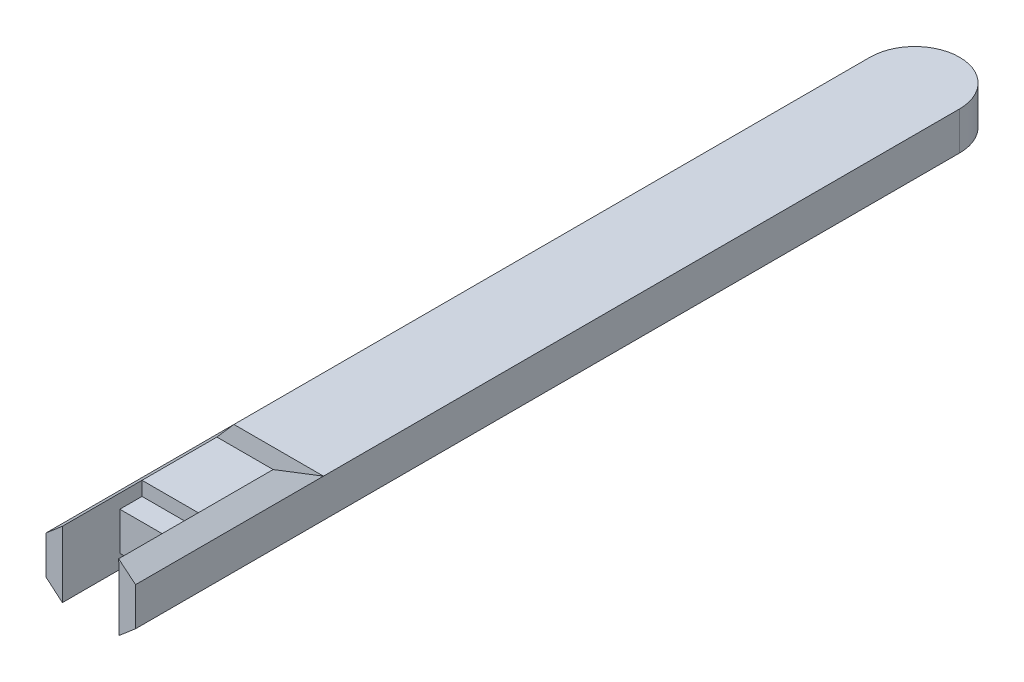
ISO-10303-21;
HEADER;
FILE_DESCRIPTION(('STEP AP214'),'2;1');
FILE_NAME('part.step','',(''),(''),'','','');
FILE_SCHEMA(('AUTOMOTIVE_DESIGN { 1 0 10303 214 1 1 1 1 }'));
ENDSEC;
DATA;
#1=APPLICATION_CONTEXT('core data for automotive mechanical design processes');
#2=APPLICATION_PROTOCOL_DEFINITION('international standard','automotive_design',2000,#1);
#3=PRODUCT_CONTEXT('',#1,'mechanical');
#4=PRODUCT('Part','Part','',(#3));
#5=PRODUCT_RELATED_PRODUCT_CATEGORY('part','',(#4));
#6=PRODUCT_DEFINITION_FORMATION('','',#4);
#7=PRODUCT_DEFINITION_CONTEXT('part definition',#1,'design');
#8=PRODUCT_DEFINITION('design','',#6,#7);
#9=PRODUCT_DEFINITION_SHAPE('','',#8);
#10=(LENGTH_UNIT() NAMED_UNIT(*) SI_UNIT(.MILLI.,.METRE.));
#11=(NAMED_UNIT(*) PLANE_ANGLE_UNIT() SI_UNIT($,.RADIAN.));
#12=(NAMED_UNIT(*) SI_UNIT($,.STERADIAN.) SOLID_ANGLE_UNIT());
#13=UNCERTAINTY_MEASURE_WITH_UNIT(LENGTH_MEASURE(1.E-05),#10,'distance_accuracy_value','');
#14=(GEOMETRIC_REPRESENTATION_CONTEXT(3) GLOBAL_UNCERTAINTY_ASSIGNED_CONTEXT((#13)) GLOBAL_UNIT_ASSIGNED_CONTEXT((#10,
#11,#12)) REPRESENTATION_CONTEXT('',''));
#15=CARTESIAN_POINT('',(0.,0.,0.));
#16=DIRECTION('',(0.,0.,1.));
#17=DIRECTION('',(1.,0.,0.));
#18=AXIS2_PLACEMENT_3D('',#15,#16,#17);
#19=CARTESIAN_POINT('',(0.,0.,0.));
#20=DIRECTION('',(0.,1.,0.));
#21=DIRECTION('',(0.,0.,1.));
#22=AXIS2_PLACEMENT_3D('',#19,#20,#21);
#23=PLANE('',#22);
#24=DIRECTION('',(0.,0.,1.));
#25=VECTOR('',#24,1.);
#26=CARTESIAN_POINT('',(-4.24999999999999,0.,49.7));
#27=LINE('',#26,#25);
#28=CARTESIAN_POINT('',(-4.24999999999999,0.,49.73));
#29=VERTEX_POINT('',#28);
#30=CARTESIAN_POINT('',(-4.24999999999999,0.,53.05));
#31=VERTEX_POINT('',#30);
#32=EDGE_CURVE('E403',#29,#31,#27,.T.);
#33=ORIENTED_EDGE('',*,*,#32,.F.);
#34=DIRECTION('',(1.,0.,0.));
#35=VECTOR('',#34,1.);
#36=CARTESIAN_POINT('',(-6.69999999999999,0.,49.73));
#37=LINE('',#36,#35);
#38=CARTESIAN_POINT('',(4.24550605108262,0.,49.73));
#39=VERTEX_POINT('',#38);
#40=EDGE_CURVE('E209',#29,#39,#37,.T.);
#41=ORIENTED_EDGE('',*,*,#40,.T.);
#42=DIRECTION('',(0.,0.,1.));
#43=VECTOR('',#42,1.);
#44=CARTESIAN_POINT('',(4.24550605108262,0.,49.7));
#45=LINE('',#44,#43);
#46=CARTESIAN_POINT('',(4.24550605108262,0.,53.05));
#47=VERTEX_POINT('',#46);
#48=EDGE_CURVE('E378',#39,#47,#45,.T.);
#49=ORIENTED_EDGE('',*,*,#48,.T.);
#50=DIRECTION('',(1.,0.,0.));
#51=VECTOR('',#50,1.);
#52=CARTESIAN_POINT('',(-4.24999999999999,0.,53.05));
#53=LINE('',#52,#51);
#54=EDGE_CURVE('E322',#31,#47,#53,.T.);
#55=ORIENTED_EDGE('',*,*,#54,.F.);
#56=EDGE_LOOP('',(#33,#41,#49,#55));
#57=FACE_BOUND('',#56,.T.);
#58=ADVANCED_FACE('F46',(#57),#23,.F.);
#59=CARTESIAN_POINT('',(-6.69999999999999,-2.09,49.73));
#60=DIRECTION('',(0.,0.,1.));
#61=DIRECTION('',(1.,0.,0.));
#62=AXIS2_PLACEMENT_3D('',#59,#60,#61);
#63=PLANE('',#62);
#64=ORIENTED_EDGE('',*,*,#40,.F.);
#65=DIRECTION('',(0.,-1.,0.));
#66=VECTOR('',#65,1.);
#67=CARTESIAN_POINT('',(-4.24999999999999,-2.09,49.73));
#68=LINE('',#67,#66);
#69=CARTESIAN_POINT('',(-4.24999999999999,-2.09,49.73));
#70=VERTEX_POINT('',#69);
#71=EDGE_CURVE('E399',#29,#70,#68,.T.);
#72=ORIENTED_EDGE('',*,*,#71,.T.);
#73=DIRECTION('',(1.,0.,0.));
#74=VECTOR('',#73,1.);
#75=CARTESIAN_POINT('',(-6.69999999999999,-2.09,49.73));
#76=LINE('',#75,#74);
#77=CARTESIAN_POINT('',(4.24550605108262,-2.09,49.73));
#78=VERTEX_POINT('',#77);
#79=EDGE_CURVE('E215',#70,#78,#76,.T.);
#80=ORIENTED_EDGE('',*,*,#79,.T.);
#81=DIRECTION('',(0.,-1.,0.));
#82=VECTOR('',#81,1.);
#83=CARTESIAN_POINT('',(4.24550605108261,-2.09,49.73));
#84=LINE('',#83,#82);
#85=EDGE_CURVE('E370',#39,#78,#84,.T.);
#86=ORIENTED_EDGE('',*,*,#85,.F.);
#87=EDGE_LOOP('',(#64,#72,#80,#86));
#88=FACE_BOUND('',#87,.T.);
#89=ADVANCED_FACE('F422',(#88),#63,.T.);
#90=CARTESIAN_POINT('',(-6.69999999999999,0.,49.73));
#91=DIRECTION('',(0.,0.,1.));
#92=DIRECTION('',(1.,0.,0.));
#93=AXIS2_PLACEMENT_3D('',#90,#91,#92);
#94=PLANE('',#93);
#95=DIRECTION('',(0.0384362054872678,-0.999261056034778,0.));
#96=VECTOR('',#95,1.);
#97=CARTESIAN_POINT('',(4.45351574107098,0.429015841596412,49.73));
#98=LINE('',#97,#96);
#99=CARTESIAN_POINT('',(4.16960892603265,7.81,49.73));
#100=VERTEX_POINT('',#99);
#101=CARTESIAN_POINT('',(4.25000000000001,5.72,49.73));
#102=VERTEX_POINT('',#101);
#103=EDGE_CURVE('E284',#100,#102,#98,.T.);
#104=ORIENTED_EDGE('',*,*,#103,.F.);
#105=DIRECTION('',(1.,0.,0.));
#106=VECTOR('',#105,1.);
#107=CARTESIAN_POINT('',(-6.69999999999999,7.81,49.73));
#108=LINE('',#107,#106);
#109=CARTESIAN_POINT('',(-4.24999999999999,7.81,49.73));
#110=VERTEX_POINT('',#109);
#111=EDGE_CURVE('E231',#110,#100,#108,.T.);
#112=ORIENTED_EDGE('',*,*,#111,.F.);
#113=DIRECTION('',(0.,1.,0.));
#114=VECTOR('',#113,1.);
#115=CARTESIAN_POINT('',(-4.24999999999999,0.,49.73));
#116=LINE('',#115,#114);
#117=CARTESIAN_POINT('',(-4.24999999999999,5.72,49.73));
#118=VERTEX_POINT('',#117);
#119=EDGE_CURVE('E305',#118,#110,#116,.T.);
#120=ORIENTED_EDGE('',*,*,#119,.F.);
#121=DIRECTION('',(1.,0.,0.));
#122=VECTOR('',#121,1.);
#123=CARTESIAN_POINT('',(-6.69999999999999,5.72,49.73));
#124=LINE('',#123,#122);
#125=EDGE_CURVE('E227',#118,#102,#124,.T.);
#126=ORIENTED_EDGE('',*,*,#125,.T.);
#127=EDGE_LOOP('',(#104,#112,#120,#126));
#128=FACE_BOUND('',#127,.T.);
#129=ADVANCED_FACE('F291',(#128),#94,.T.);
#130=CARTESIAN_POINT('',(0.,5.72,61.65));
#131=DIRECTION('',(0.,0.,1.));
#132=DIRECTION('',(1.,0.,0.));
#133=AXIS2_PLACEMENT_3D('',#130,#131,#132);
#134=PLANE('',#133);
#135=DIRECTION('',(0.,-1.,0.));
#136=VECTOR('',#135,1.);
#137=CARTESIAN_POINT('',(4.25000000000001,13.4,61.65));
#138=LINE('',#137,#136);
#139=CARTESIAN_POINT('',(4.25000000000001,5.72,61.65));
#140=VERTEX_POINT('',#139);
#141=CARTESIAN_POINT('',(4.25000000000001,0.,61.65));
#142=VERTEX_POINT('',#141);
#143=EDGE_CURVE('E331',#140,#142,#138,.T.);
#144=ORIENTED_EDGE('',*,*,#143,.T.);
#145=DIRECTION('',(-1.,0.,0.));
#146=VECTOR('',#145,1.);
#147=CARTESIAN_POINT('',(6.70000000000001,0.,61.65));
#148=LINE('',#147,#146);
#149=CARTESIAN_POINT('',(4.24550605108262,0.,61.65));
#150=VERTEX_POINT('',#149);
#151=EDGE_CURVE('E389',#142,#150,#148,.T.);
#152=ORIENTED_EDGE('',*,*,#151,.T.);
#153=DIRECTION('',(0.,-1.,0.));
#154=VECTOR('',#153,1.);
#155=CARTESIAN_POINT('',(4.24550605108262,0.,61.65));
#156=LINE('',#155,#154);
#157=CARTESIAN_POINT('',(4.24550605108262,-2.09,61.65));
#158=VERTEX_POINT('',#157);
#159=EDGE_CURVE('E385',#150,#158,#156,.T.);
#160=ORIENTED_EDGE('',*,*,#159,.T.);
#161=DIRECTION('',(0.761375701340681,0.648310914151525,0.));
#162=VECTOR('',#161,1.);
#163=CARTESIAN_POINT('',(4.24550605108262,-2.09,61.65));
#164=LINE('',#163,#162);
#165=CARTESIAN_POINT('',(6.70000000000001,0.,61.65));
#166=VERTEX_POINT('',#165);
#167=EDGE_CURVE('E379',#158,#166,#164,.T.);
#168=ORIENTED_EDGE('',*,*,#167,.T.);
#169=DIRECTION('',(0.,-1.,0.));
#170=VECTOR('',#169,1.);
#171=CARTESIAN_POINT('',(6.70000000000001,5.72,61.65));
#172=LINE('',#171,#170);
#173=CARTESIAN_POINT('',(6.70000000000001,5.72,61.65));
#174=VERTEX_POINT('',#173);
#175=EDGE_CURVE('E248',#174,#166,#172,.T.);
#176=ORIENTED_EDGE('',*,*,#175,.F.);
#177=DIRECTION('',(-0.771010082936772,0.636822936152454,0.));
#178=VECTOR('',#177,1.);
#179=CARTESIAN_POINT('',(6.70000000000001,5.72,61.65));
#180=LINE('',#179,#178);
#181=CARTESIAN_POINT('',(4.16960892603265,7.81,61.65));
#182=VERTEX_POINT('',#181);
#183=EDGE_CURVE('E364',#174,#182,#180,.T.);
#184=ORIENTED_EDGE('',*,*,#183,.T.);
#185=DIRECTION('',(0.0384362054872678,-0.999261056034778,0.));
#186=VECTOR('',#185,1.);
#187=CARTESIAN_POINT('',(4.16960892603265,7.81,61.65));
#188=LINE('',#187,#186);
#189=EDGE_CURVE('E286',#182,#140,#188,.T.);
#190=ORIENTED_EDGE('',*,*,#189,.T.);
#191=EDGE_LOOP('',(#144,#152,#160,#168,#176,#184,#190));
#192=FACE_BOUND('',#191,.T.);
#193=ADVANCED_FACE('F433',(#192),#134,.T.);
#194=DIRECTION('',(1.,0.,0.));
#195=VECTOR('',#194,1.);
#196=CARTESIAN_POINT('',(-6.69999999999999,0.,33.53));
#197=LINE('',#196,#195);
#198=CARTESIAN_POINT('',(-6.69999999999999,0.,33.53));
#199=VERTEX_POINT('',#198);
#200=CARTESIAN_POINT('',(6.70000000000001,0.,33.53));
#201=VERTEX_POINT('',#200);
#202=EDGE_CURVE('E201',#199,#201,#197,.T.);
#203=ORIENTED_EDGE('',*,*,#202,.F.);
#204=DIRECTION('',(0.,0.,1.));
#205=VECTOR('',#204,1.);
#206=CARTESIAN_POINT('',(-6.7,0.,0.));
#207=LINE('',#206,#205);
#208=CARTESIAN_POINT('',(-6.70000000000001,0.,-61.65));
#209=VERTEX_POINT('',#208);
#210=EDGE_CURVE('E174',#209,#199,#207,.T.);
#211=ORIENTED_EDGE('',*,*,#210,.F.);
#212=CARTESIAN_POINT('',(0.,0.,-61.65));
#213=DIRECTION('',(0.,1.,0.));
#214=DIRECTION('',(0.,0.,1.));
#215=AXIS2_PLACEMENT_3D('',#212,#213,#214);
#216=CIRCLE('',#215,6.7);
#217=CARTESIAN_POINT('',(6.69999999999999,0.,-61.65));
#218=VERTEX_POINT('',#217);
#219=EDGE_CURVE('E195',#209,#218,#216,.F.);
#220=ORIENTED_EDGE('',*,*,#219,.T.);
#221=DIRECTION('',(0.,0.,1.));
#222=VECTOR('',#221,1.);
#223=CARTESIAN_POINT('',(6.7,0.,0.));
#224=LINE('',#223,#222);
#225=EDGE_CURVE('E206',#218,#201,#224,.T.);
#226=ORIENTED_EDGE('',*,*,#225,.T.);
#227=EDGE_LOOP('',(#203,#211,#220,#226));
#228=FACE_BOUND('',#227,.T.);
#229=ADVANCED_FACE('F205',(#228),#23,.F.);
#230=CARTESIAN_POINT('',(0.,5.72,0.));
#231=DIRECTION('',(0.,1.,0.));
#232=DIRECTION('',(0.,0.,1.));
#233=AXIS2_PLACEMENT_3D('',#230,#231,#232);
#234=PLANE('',#233);
#235=DIRECTION('',(0.,0.,1.));
#236=VECTOR('',#235,1.);
#237=CARTESIAN_POINT('',(-6.7,5.72,0.));
#238=LINE('',#237,#236);
#239=CARTESIAN_POINT('',(-6.70000000000001,5.72,-61.65));
#240=VERTEX_POINT('',#239);
#241=CARTESIAN_POINT('',(-6.69999999999999,5.72000000000001,33.53));
#242=VERTEX_POINT('',#241);
#243=EDGE_CURVE('E245',#240,#242,#238,.T.);
#244=ORIENTED_EDGE('',*,*,#243,.T.);
#245=DIRECTION('',(1.,0.,0.));
#246=VECTOR('',#245,1.);
#247=CARTESIAN_POINT('',(-6.69999999999999,5.72,33.53));
#248=LINE('',#247,#246);
#249=CARTESIAN_POINT('',(6.70000000000001,5.72000000000001,33.53));
#250=VERTEX_POINT('',#249);
#251=EDGE_CURVE('E222',#242,#250,#248,.T.);
#252=ORIENTED_EDGE('',*,*,#251,.T.);
#253=DIRECTION('',(0.,0.,1.));
#254=VECTOR('',#253,1.);
#255=CARTESIAN_POINT('',(6.7,5.72,0.));
#256=LINE('',#255,#254);
#257=CARTESIAN_POINT('',(6.69999999999999,5.72,-61.65));
#258=VERTEX_POINT('',#257);
#259=EDGE_CURVE('E238',#258,#250,#256,.T.);
#260=ORIENTED_EDGE('',*,*,#259,.F.);
#261=CARTESIAN_POINT('',(0.,5.72,-61.65));
#262=DIRECTION('',(0.,1.,0.));
#263=DIRECTION('',(0.,0.,1.));
#264=AXIS2_PLACEMENT_3D('',#261,#262,#263);
#265=CIRCLE('',#264,6.7);
#266=EDGE_CURVE('E241',#240,#258,#265,.F.);
#267=ORIENTED_EDGE('',*,*,#266,.F.);
#268=EDGE_LOOP('',(#244,#252,#260,#267));
#269=FACE_BOUND('',#268,.T.);
#270=ADVANCED_FACE('F464',(#269),#234,.T.);
#271=CARTESIAN_POINT('',(6.7,5.72,0.));
#272=DIRECTION('',(1.,0.,0.));
#273=DIRECTION('',(0.,0.,-1.));
#274=AXIS2_PLACEMENT_3D('',#271,#272,#273);
#275=PLANE('',#274);
#276=ORIENTED_EDGE('',*,*,#259,.T.);
#277=EDGE_CURVE('E184',#250,#174,#256,.T.);
#278=ORIENTED_EDGE('',*,*,#277,.T.);
#279=ORIENTED_EDGE('',*,*,#175,.T.);
#280=EDGE_CURVE('E226',#201,#166,#224,.T.);
#281=ORIENTED_EDGE('',*,*,#280,.F.);
#282=ORIENTED_EDGE('',*,*,#225,.F.);
#283=DIRECTION('',(0.,-1.,0.));
#284=VECTOR('',#283,1.);
#285=CARTESIAN_POINT('',(6.69999999999999,5.72,-61.65));
#286=LINE('',#285,#284);
#287=EDGE_CURVE('E72',#258,#218,#286,.T.);
#288=ORIENTED_EDGE('',*,*,#287,.F.);
#289=EDGE_LOOP('',(#276,#278,#279,#281,#282,#288));
#290=FACE_BOUND('',#289,.T.);
#291=ADVANCED_FACE('F48',(#290),#275,.T.);
#292=CARTESIAN_POINT('',(0.,5.72,-61.65));
#293=DIRECTION('',(0.,-1.,0.));
#294=DIRECTION('',(0.,0.,-1.));
#295=AXIS2_PLACEMENT_3D('',#292,#293,#294);
#296=CYLINDRICAL_SURFACE('',#295,6.7);
#297=ORIENTED_EDGE('',*,*,#219,.F.);
#298=DIRECTION('',(0.,-1.,0.));
#299=VECTOR('',#298,1.);
#300=CARTESIAN_POINT('',(-6.70000000000001,5.72,-61.65));
#301=LINE('',#300,#299);
#302=EDGE_CURVE('E64',#240,#209,#301,.T.);
#303=ORIENTED_EDGE('',*,*,#302,.F.);
#304=ORIENTED_EDGE('',*,*,#266,.T.);
#305=ORIENTED_EDGE('',*,*,#287,.T.);
#306=EDGE_LOOP('',(#297,#303,#304,#305));
#307=FACE_BOUND('',#306,.T.);
#308=ADVANCED_FACE('F481',(#307),#296,.T.);
#309=CARTESIAN_POINT('',(-6.7,5.72,0.));
#310=DIRECTION('',(1.,0.,0.));
#311=DIRECTION('',(0.,0.,-1.));
#312=AXIS2_PLACEMENT_3D('',#309,#310,#311);
#313=PLANE('',#312);
#314=ORIENTED_EDGE('',*,*,#210,.T.);
#315=CARTESIAN_POINT('',(-6.69999999999999,0.,61.65));
#316=VERTEX_POINT('',#315);
#317=EDGE_CURVE('E178',#199,#316,#207,.T.);
#318=ORIENTED_EDGE('',*,*,#317,.T.);
#319=DIRECTION('',(0.,-1.,0.));
#320=VECTOR('',#319,1.);
#321=CARTESIAN_POINT('',(-6.69999999999999,5.72,61.65));
#322=LINE('',#321,#320);
#323=CARTESIAN_POINT('',(-6.69999999999999,5.72,61.65));
#324=VERTEX_POINT('',#323);
#325=EDGE_CURVE('E256',#324,#316,#322,.T.);
#326=ORIENTED_EDGE('',*,*,#325,.F.);
#327=EDGE_CURVE('E244',#242,#324,#238,.T.);
#328=ORIENTED_EDGE('',*,*,#327,.F.);
#329=ORIENTED_EDGE('',*,*,#243,.F.);
#330=ORIENTED_EDGE('',*,*,#302,.T.);
#331=EDGE_LOOP('',(#314,#318,#326,#328,#329,#330));
#332=FACE_BOUND('',#331,.T.);
#333=ADVANCED_FACE('F176',(#332),#313,.F.);
#334=DIRECTION('',(0.,-1.,0.));
#335=VECTOR('',#334,1.);
#336=CARTESIAN_POINT('',(-4.24999999999999,13.4,61.65));
#337=LINE('',#336,#335);
#338=CARTESIAN_POINT('',(-4.24999999999999,7.81,61.65));
#339=VERTEX_POINT('',#338);
#340=CARTESIAN_POINT('',(-4.24999999999999,-2.09,61.65));
#341=VERTEX_POINT('',#340);
#342=EDGE_CURVE('E330',#339,#341,#337,.T.);
#343=ORIENTED_EDGE('',*,*,#342,.F.);
#344=DIRECTION('',(-0.760788856202093,-0.648999473249949,0.));
#345=VECTOR('',#344,1.);
#346=CARTESIAN_POINT('',(-6.69999999999999,5.72,61.65));
#347=LINE('',#346,#345);
#348=EDGE_CURVE('E295',#339,#324,#347,.T.);
#349=ORIENTED_EDGE('',*,*,#348,.T.);
#350=ORIENTED_EDGE('',*,*,#325,.T.);
#351=DIRECTION('',(-0.760788856202093,0.648999473249949,0.));
#352=VECTOR('',#351,1.);
#353=CARTESIAN_POINT('',(-2.82204211906736,-3.30813549842825,61.65));
#354=LINE('',#353,#352);
#355=EDGE_CURVE('E193',#341,#316,#354,.T.);
#356=ORIENTED_EDGE('',*,*,#355,.F.);
#357=EDGE_LOOP('',(#343,#349,#350,#356));
#358=FACE_BOUND('',#357,.T.);
#359=ADVANCED_FACE('F443',(#358),#134,.T.);
#360=DIRECTION('',(0.,0.,1.));
#361=VECTOR('',#360,1.);
#362=CARTESIAN_POINT('',(4.25000000000001,5.72,49.7));
#363=LINE('',#362,#361);
#364=CARTESIAN_POINT('',(4.25000000000001,5.72,53.05));
#365=VERTEX_POINT('',#364);
#366=EDGE_CURVE('E80',#102,#365,#363,.T.);
#367=ORIENTED_EDGE('',*,*,#366,.F.);
#368=ORIENTED_EDGE('',*,*,#125,.F.);
#369=DIRECTION('',(0.,0.,1.));
#370=VECTOR('',#369,1.);
#371=CARTESIAN_POINT('',(-4.24999999999999,5.72,49.7));
#372=LINE('',#371,#370);
#373=CARTESIAN_POINT('',(-4.24999999999999,5.72,53.05));
#374=VERTEX_POINT('',#373);
#375=EDGE_CURVE('E310',#118,#374,#372,.T.);
#376=ORIENTED_EDGE('',*,*,#375,.T.);
#377=DIRECTION('',(-1.,0.,0.));
#378=VECTOR('',#377,1.);
#379=CARTESIAN_POINT('',(0.,5.72,53.05));
#380=LINE('',#379,#378);
#381=EDGE_CURVE('E335',#365,#374,#380,.T.);
#382=ORIENTED_EDGE('',*,*,#381,.F.);
#383=EDGE_LOOP('',(#367,#368,#376,#382));
#384=FACE_BOUND('',#383,.T.);
#385=ADVANCED_FACE('F358',(#384),#234,.T.);
#386=CARTESIAN_POINT('',(-6.7,-7.06169278911472,2.95178758584996));
#387=DIRECTION('',(0.,-0.922639575466508,0.385663342545001));
#388=DIRECTION('',(0.,-0.385663342545001,-0.922639575466508));
#389=AXIS2_PLACEMENT_3D('',#386,#387,#388);
#390=PLANE('',#389);
#391=DIRECTION('',(1.,0.,0.));
#392=VECTOR('',#391,1.);
#393=CARTESIAN_POINT('',(-6.69999999999999,7.81,38.53));
#394=LINE('',#393,#392);
#395=CARTESIAN_POINT('',(-4.24999999999999,7.81,38.53));
#396=VERTEX_POINT('',#395);
#397=CARTESIAN_POINT('',(4.16960892603265,7.81,38.53));
#398=VERTEX_POINT('',#397);
#399=EDGE_CURVE('E213',#396,#398,#394,.T.);
#400=ORIENTED_EDGE('',*,*,#399,.T.);
#401=DIRECTION('',(0.423079744919018,-0.349446643239366,-0.835996754161162));
#402=VECTOR('',#401,1.);
#403=CARTESIAN_POINT('',(17.0064499426983,-2.79270801649897,13.1646698169881));
#404=LINE('',#403,#402);
#405=EDGE_CURVE('E278',#398,#250,#404,.T.);
#406=ORIENTED_EDGE('',*,*,#405,.T.);
#407=ORIENTED_EDGE('',*,*,#251,.F.);
#408=DIRECTION('',(0.41195034499847,0.351418865733389,0.840714989792795));
#409=VECTOR('',#408,1.);
#410=CARTESIAN_POINT('',(-19.1406077363686,-4.89260006898385,8.14100461965587));
#411=LINE('',#410,#409);
#412=EDGE_CURVE('E367',#242,#396,#411,.T.);
#413=ORIENTED_EDGE('',*,*,#412,.T.);
#414=EDGE_LOOP('',(#400,#406,#407,#413));
#415=FACE_BOUND('',#414,.T.);
#416=ADVANCED_FACE('F480',(#415),#390,.F.);
#417=CARTESIAN_POINT('',(-6.7,7.81000000000001,0.));
#418=DIRECTION('',(0.,1.,0.));
#419=DIRECTION('',(0.,0.,1.));
#420=AXIS2_PLACEMENT_3D('',#417,#418,#419);
#421=PLANE('',#420);
#422=DIRECTION('',(0.,0.,1.));
#423=VECTOR('',#422,1.);
#424=CARTESIAN_POINT('',(4.16960892603264,7.81000000000001,0.));
#425=LINE('',#424,#423);
#426=EDGE_CURVE('E56',#398,#100,#425,.T.);
#427=ORIENTED_EDGE('',*,*,#426,.F.);
#428=ORIENTED_EDGE('',*,*,#399,.F.);
#429=DIRECTION('',(0.,0.,-1.));
#430=VECTOR('',#429,1.);
#431=CARTESIAN_POINT('',(-4.24999999999998,7.81000000000001,0.));
#432=LINE('',#431,#430);
#433=EDGE_CURVE('E263',#110,#396,#432,.T.);
#434=ORIENTED_EDGE('',*,*,#433,.F.);
#435=ORIENTED_EDGE('',*,*,#111,.T.);
#436=EDGE_LOOP('',(#427,#428,#434,#435));
#437=FACE_BOUND('',#436,.T.);
#438=ADVANCED_FACE('F297',(#437),#421,.T.);
#439=CARTESIAN_POINT('',(-6.69999999999999,0.,33.53));
#440=DIRECTION('',(0.,-0.922639575466508,-0.385663342545001));
#441=DIRECTION('',(0.,0.385663342545001,-0.922639575466508));
#442=AXIS2_PLACEMENT_3D('',#439,#440,#441);
#443=PLANE('',#442);
#444=DIRECTION('',(0.41195034499847,-0.351418865733389,0.840714989792795));
#445=VECTOR('',#444,1.);
#446=CARTESIAN_POINT('',(-6.69999999999999,0.,33.53));
#447=LINE('',#446,#445);
#448=CARTESIAN_POINT('',(-4.24999999999999,-2.09,38.53));
#449=VERTEX_POINT('',#448);
#450=EDGE_CURVE('E189',#199,#449,#447,.T.);
#451=ORIENTED_EDGE('',*,*,#450,.F.);
#452=ORIENTED_EDGE('',*,*,#202,.T.);
#453=DIRECTION('',(0.412577445999898,0.351309426743593,-0.840453174027733));
#454=VECTOR('',#453,1.);
#455=CARTESIAN_POINT('',(4.41905000409951,-1.9422274369569,38.1764771219064));
#456=LINE('',#455,#454);
#457=CARTESIAN_POINT('',(4.24550605108262,-2.09,38.53));
#458=VERTEX_POINT('',#457);
#459=EDGE_CURVE('E393',#458,#201,#456,.T.);
#460=ORIENTED_EDGE('',*,*,#459,.F.);
#461=DIRECTION('',(1.,0.,0.));
#462=VECTOR('',#461,1.);
#463=CARTESIAN_POINT('',(-6.69999999999999,-2.09,38.53));
#464=LINE('',#463,#462);
#465=EDGE_CURVE('E202',#449,#458,#464,.T.);
#466=ORIENTED_EDGE('',*,*,#465,.F.);
#467=EDGE_LOOP('',(#451,#452,#460,#466));
#468=FACE_BOUND('',#467,.T.);
#469=ADVANCED_FACE('F199',(#468),#443,.T.);
#470=CARTESIAN_POINT('',(-6.69999999999999,-2.09,38.53));
#471=DIRECTION('',(0.,-1.,0.));
#472=DIRECTION('',(0.,0.,-1.));
#473=AXIS2_PLACEMENT_3D('',#470,#471,#472);
#474=PLANE('',#473);
#475=DIRECTION('',(0.,0.,1.));
#476=VECTOR('',#475,1.);
#477=CARTESIAN_POINT('',(-4.24999999999999,-2.09,38.53));
#478=LINE('',#477,#476);
#479=EDGE_CURVE('E11',#449,#70,#478,.T.);
#480=ORIENTED_EDGE('',*,*,#479,.F.);
#481=ORIENTED_EDGE('',*,*,#465,.T.);
#482=DIRECTION('',(0.,0.,-1.));
#483=VECTOR('',#482,1.);
#484=CARTESIAN_POINT('',(4.24550605108261,-2.09,38.53));
#485=LINE('',#484,#483);
#486=EDGE_CURVE('E266',#78,#458,#485,.T.);
#487=ORIENTED_EDGE('',*,*,#486,.F.);
#488=ORIENTED_EDGE('',*,*,#79,.F.);
#489=EDGE_LOOP('',(#480,#481,#487,#488));
#490=FACE_BOUND('',#489,.T.);
#491=ADVANCED_FACE('F446',(#490),#474,.T.);
#492=CARTESIAN_POINT('',(4.25000000000001,13.4,53.05));
#493=DIRECTION('',(1.,0.,0.));
#494=DIRECTION('',(0.,0.,-1.));
#495=AXIS2_PLACEMENT_3D('',#492,#493,#494);
#496=PLANE('',#495);
#497=DIRECTION('',(0.,0.,-1.));
#498=VECTOR('',#497,1.);
#499=CARTESIAN_POINT('',(4.25000000000001,5.72,0.));
#500=LINE('',#499,#498);
#501=EDGE_CURVE('E221',#140,#365,#500,.T.);
#502=ORIENTED_EDGE('',*,*,#501,.T.);
#503=DIRECTION('',(0.,-1.,0.));
#504=VECTOR('',#503,1.);
#505=CARTESIAN_POINT('',(4.25000000000001,13.4,53.05));
#506=LINE('',#505,#504);
#507=CARTESIAN_POINT('',(4.25000000000001,0.,53.05));
#508=VERTEX_POINT('',#507);
#509=EDGE_CURVE('E336',#365,#508,#506,.T.);
#510=ORIENTED_EDGE('',*,*,#509,.T.);
#511=DIRECTION('',(0.,0.,1.));
#512=VECTOR('',#511,1.);
#513=CARTESIAN_POINT('',(4.25000000000001,0.,53.05));
#514=LINE('',#513,#512);
#515=EDGE_CURVE('E326',#508,#142,#514,.T.);
#516=ORIENTED_EDGE('',*,*,#515,.T.);
#517=ORIENTED_EDGE('',*,*,#143,.F.);
#518=EDGE_LOOP('',(#502,#510,#516,#517));
#519=FACE_BOUND('',#518,.T.);
#520=ADVANCED_FACE('F352',(#519),#496,.F.);
#521=CARTESIAN_POINT('',(-4.24999999999999,13.4,53.05));
#522=DIRECTION('',(0.,0.,-1.));
#523=DIRECTION('',(-1.,0.,0.));
#524=AXIS2_PLACEMENT_3D('',#521,#522,#523);
#525=PLANE('',#524);
#526=ORIENTED_EDGE('',*,*,#381,.T.);
#527=DIRECTION('',(0.,-1.,0.));
#528=VECTOR('',#527,1.);
#529=CARTESIAN_POINT('',(-4.24999999999999,13.4,53.05));
#530=LINE('',#529,#528);
#531=EDGE_CURVE('E340',#374,#31,#530,.T.);
#532=ORIENTED_EDGE('',*,*,#531,.T.);
#533=ORIENTED_EDGE('',*,*,#54,.T.);
#534=EDGE_CURVE('E312',#47,#508,#53,.T.);
#535=ORIENTED_EDGE('',*,*,#534,.T.);
#536=ORIENTED_EDGE('',*,*,#509,.F.);
#537=EDGE_LOOP('',(#526,#532,#533,#535,#536));
#538=FACE_BOUND('',#537,.T.);
#539=ADVANCED_FACE('F356',(#538),#525,.F.);
#540=CARTESIAN_POINT('',(-4.24999999999999,13.4,61.65));
#541=DIRECTION('',(-1.,0.,0.));
#542=DIRECTION('',(0.,0.,1.));
#543=AXIS2_PLACEMENT_3D('',#540,#541,#542);
#544=PLANE('',#543);
#545=ORIENTED_EDGE('',*,*,#531,.F.);
#546=ORIENTED_EDGE('',*,*,#375,.F.);
#547=ORIENTED_EDGE('',*,*,#119,.T.);
#548=DIRECTION('',(0.,0.,1.));
#549=VECTOR('',#548,1.);
#550=CARTESIAN_POINT('',(-4.24999999999999,7.81,49.7));
#551=LINE('',#550,#549);
#552=EDGE_CURVE('E308',#110,#339,#551,.T.);
#553=ORIENTED_EDGE('',*,*,#552,.T.);
#554=ORIENTED_EDGE('',*,*,#342,.T.);
#555=DIRECTION('',(0.,0.,1.));
#556=VECTOR('',#555,1.);
#557=CARTESIAN_POINT('',(-4.24999999999999,-2.09,49.7));
#558=LINE('',#557,#556);
#559=EDGE_CURVE('E404',#70,#341,#558,.T.);
#560=ORIENTED_EDGE('',*,*,#559,.F.);
#561=ORIENTED_EDGE('',*,*,#71,.F.);
#562=ORIENTED_EDGE('',*,*,#32,.T.);
#563=EDGE_LOOP('',(#545,#546,#547,#553,#554,#560,#561,#562));
#564=FACE_BOUND('',#563,.T.);
#565=ADVANCED_FACE('F307',(#564),#544,.F.);
#566=CARTESIAN_POINT('',(-6.69999999999999,5.72,49.7));
#567=DIRECTION('',(-0.648999473249949,0.760788856202093,0.));
#568=DIRECTION('',(-0.760788856202093,-0.648999473249949,0.));
#569=AXIS2_PLACEMENT_3D('',#566,#567,#568);
#570=PLANE('',#569);
#571=ORIENTED_EDGE('',*,*,#552,.F.);
#572=ORIENTED_EDGE('',*,*,#433,.T.);
#573=ORIENTED_EDGE('',*,*,#412,.F.);
#574=ORIENTED_EDGE('',*,*,#327,.T.);
#575=ORIENTED_EDGE('',*,*,#348,.F.);
#576=EDGE_LOOP('',(#571,#572,#573,#574,#575));
#577=FACE_BOUND('',#576,.T.);
#578=ADVANCED_FACE('F314',(#577),#570,.T.);
#579=CARTESIAN_POINT('',(4.16960892603265,7.81,49.7));
#580=DIRECTION('',(-0.999261056034778,-0.0384362054872678,0.));
#581=DIRECTION('',(0.0384362054872678,-0.999261056034778,0.));
#582=AXIS2_PLACEMENT_3D('',#579,#580,#581);
#583=PLANE('',#582);
#584=DIRECTION('',(0.,0.,1.));
#585=VECTOR('',#584,1.);
#586=CARTESIAN_POINT('',(4.16960892603265,7.81,49.7));
#587=LINE('',#586,#585);
#588=EDGE_CURVE('E275',#100,#182,#587,.T.);
#589=ORIENTED_EDGE('',*,*,#588,.F.);
#590=ORIENTED_EDGE('',*,*,#103,.T.);
#591=ORIENTED_EDGE('',*,*,#366,.T.);
#592=ORIENTED_EDGE('',*,*,#501,.F.);
#593=ORIENTED_EDGE('',*,*,#189,.F.);
#594=EDGE_LOOP('',(#589,#590,#591,#592,#593));
#595=FACE_BOUND('',#594,.T.);
#596=ADVANCED_FACE('F283',(#595),#583,.T.);
#597=CARTESIAN_POINT('',(6.70000000000001,5.72,49.7));
#598=DIRECTION('',(0.636822936152454,0.771010082936772,0.));
#599=DIRECTION('',(-0.771010082936772,0.636822936152454,0.));
#600=AXIS2_PLACEMENT_3D('',#597,#598,#599);
#601=PLANE('',#600);
#602=ORIENTED_EDGE('',*,*,#277,.F.);
#603=ORIENTED_EDGE('',*,*,#405,.F.);
#604=ORIENTED_EDGE('',*,*,#426,.T.);
#605=ORIENTED_EDGE('',*,*,#588,.T.);
#606=ORIENTED_EDGE('',*,*,#183,.F.);
#607=EDGE_LOOP('',(#602,#603,#604,#605,#606));
#608=FACE_BOUND('',#607,.T.);
#609=ADVANCED_FACE('F274',(#608),#601,.T.);
#610=CARTESIAN_POINT('',(6.70000000000001,0.,49.7));
#611=DIRECTION('',(0.,1.,0.));
#612=DIRECTION('',(0.,0.,1.));
#613=AXIS2_PLACEMENT_3D('',#610,#611,#612);
#614=PLANE('',#613);
#615=ORIENTED_EDGE('',*,*,#515,.F.);
#616=ORIENTED_EDGE('',*,*,#534,.F.);
#617=EDGE_CURVE('E375',#47,#150,#45,.T.);
#618=ORIENTED_EDGE('',*,*,#617,.T.);
#619=ORIENTED_EDGE('',*,*,#151,.F.);
#620=EDGE_LOOP('',(#615,#616,#618,#619));
#621=FACE_BOUND('',#620,.T.);
#622=ADVANCED_FACE('F557',(#621),#614,.T.);
#623=CARTESIAN_POINT('',(4.24550605108262,-2.09,49.7));
#624=DIRECTION('',(0.648310914151525,-0.761375701340681,0.));
#625=DIRECTION('',(0.761375701340681,0.648310914151525,0.));
#626=AXIS2_PLACEMENT_3D('',#623,#624,#625);
#627=PLANE('',#626);
#628=DIRECTION('',(0.,0.,1.));
#629=VECTOR('',#628,1.);
#630=CARTESIAN_POINT('',(4.24550605108262,-2.09,49.7));
#631=LINE('',#630,#629);
#632=EDGE_CURVE('E374',#78,#158,#631,.T.);
#633=ORIENTED_EDGE('',*,*,#632,.F.);
#634=ORIENTED_EDGE('',*,*,#486,.T.);
#635=ORIENTED_EDGE('',*,*,#459,.T.);
#636=ORIENTED_EDGE('',*,*,#280,.T.);
#637=ORIENTED_EDGE('',*,*,#167,.F.);
#638=EDGE_LOOP('',(#633,#634,#635,#636,#637));
#639=FACE_BOUND('',#638,.T.);
#640=ADVANCED_FACE('F430',(#639),#627,.T.);
#641=CARTESIAN_POINT('',(4.24550605108262,0.,49.7));
#642=DIRECTION('',(-1.,0.,0.));
#643=DIRECTION('',(0.,0.,1.));
#644=AXIS2_PLACEMENT_3D('',#641,#642,#643);
#645=PLANE('',#644);
#646=ORIENTED_EDGE('',*,*,#48,.F.);
#647=ORIENTED_EDGE('',*,*,#85,.T.);
#648=ORIENTED_EDGE('',*,*,#632,.T.);
#649=ORIENTED_EDGE('',*,*,#159,.F.);
#650=ORIENTED_EDGE('',*,*,#617,.F.);
#651=EDGE_LOOP('',(#646,#647,#648,#649,#650));
#652=FACE_BOUND('',#651,.T.);
#653=ADVANCED_FACE('F426',(#652),#645,.T.);
#654=CARTESIAN_POINT('',(-2.82204211906736,-3.30813549842825,49.7));
#655=DIRECTION('',(0.648999473249949,0.760788856202093,0.));
#656=DIRECTION('',(-0.760788856202093,0.648999473249949,0.));
#657=AXIS2_PLACEMENT_3D('',#654,#655,#656);
#658=PLANE('',#657);
#659=ORIENTED_EDGE('',*,*,#317,.F.);
#660=ORIENTED_EDGE('',*,*,#450,.T.);
#661=ORIENTED_EDGE('',*,*,#479,.T.);
#662=ORIENTED_EDGE('',*,*,#559,.T.);
#663=ORIENTED_EDGE('',*,*,#355,.T.);
#664=EDGE_LOOP('',(#659,#660,#661,#662,#663));
#665=FACE_BOUND('',#664,.T.);
#666=ADVANCED_FACE('F188',(#665),#658,.F.);
#667=CLOSED_SHELL('',(#58,#89,#129,#193,#229,#270,#291,#308,#333,#359,#385,#416,#438,#469,#491,
#520,#539,#565,#578,#596,#609,#622,#640,#653,#666));
#668=MANIFOLD_SOLID_BREP('B2',#667);
#669=ADVANCED_BREP_SHAPE_REPRESENTATION('',(#18,#668),#14);
#670=SHAPE_DEFINITION_REPRESENTATION(#9,#669);
ENDSEC;
END-ISO-10303-21;
